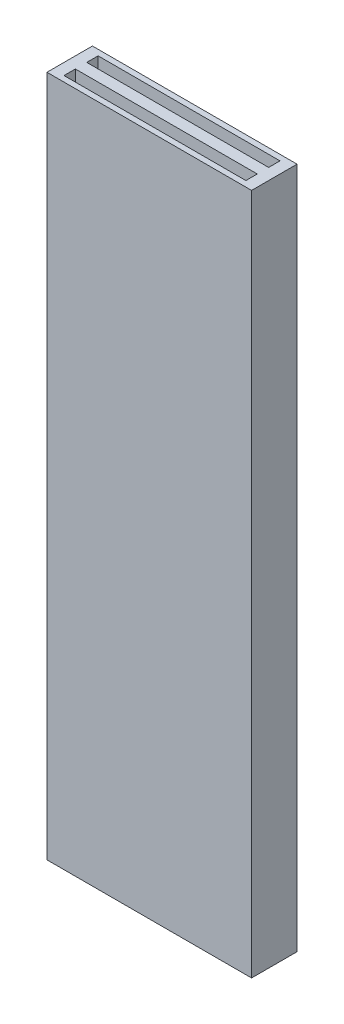
ISO-10303-21;
HEADER;
FILE_DESCRIPTION(('STEP AP214'),'2;1');
FILE_NAME('part.step','',(''),(''),'','','');
FILE_SCHEMA(('AUTOMOTIVE_DESIGN { 1 0 10303 214 1 1 1 1 }'));
ENDSEC;
DATA;
#1=APPLICATION_CONTEXT('core data for automotive mechanical design processes');
#2=APPLICATION_PROTOCOL_DEFINITION('international standard','automotive_design',2000,#1);
#3=PRODUCT_CONTEXT('',#1,'mechanical');
#4=PRODUCT('Part','Part','',(#3));
#5=PRODUCT_RELATED_PRODUCT_CATEGORY('part','',(#4));
#6=PRODUCT_DEFINITION_FORMATION('','',#4);
#7=PRODUCT_DEFINITION_CONTEXT('part definition',#1,'design');
#8=PRODUCT_DEFINITION('design','',#6,#7);
#9=PRODUCT_DEFINITION_SHAPE('','',#8);
#10=(LENGTH_UNIT() NAMED_UNIT(*) SI_UNIT(.MILLI.,.METRE.));
#11=(NAMED_UNIT(*) PLANE_ANGLE_UNIT() SI_UNIT($,.RADIAN.));
#12=(NAMED_UNIT(*) SI_UNIT($,.STERADIAN.) SOLID_ANGLE_UNIT());
#13=UNCERTAINTY_MEASURE_WITH_UNIT(LENGTH_MEASURE(1.E-05),#10,'distance_accuracy_value','');
#14=(GEOMETRIC_REPRESENTATION_CONTEXT(3) GLOBAL_UNCERTAINTY_ASSIGNED_CONTEXT((#13)) GLOBAL_UNIT_ASSIGNED_CONTEXT((#10,
#11,#12)) REPRESENTATION_CONTEXT('',''));
#15=CARTESIAN_POINT('',(0.,0.,0.));
#16=DIRECTION('',(0.,0.,1.));
#17=DIRECTION('',(1.,0.,0.));
#18=AXIS2_PLACEMENT_3D('',#15,#16,#17);
#19=CARTESIAN_POINT('',(0.,15.,0.));
#20=DIRECTION('',(0.,-1.,0.));
#21=DIRECTION('',(0.,0.,-1.));
#22=AXIS2_PLACEMENT_3D('',#19,#20,#21);
#23=PLANE('',#22);
#24=DIRECTION('',(0.,0.,-1.));
#25=VECTOR('',#24,1.);
#26=CARTESIAN_POINT('',(4.5,15.,1.));
#27=LINE('',#26,#25);
#28=CARTESIAN_POINT('',(4.5,15.,1.));
#29=VERTEX_POINT('',#28);
#30=CARTESIAN_POINT('',(4.5,15.,-1.));
#31=VERTEX_POINT('',#30);
#32=EDGE_CURVE('E222',#29,#31,#27,.T.);
#33=ORIENTED_EDGE('',*,*,#32,.T.);
#34=DIRECTION('',(-1.,0.,0.));
#35=VECTOR('',#34,1.);
#36=CARTESIAN_POINT('',(-4.5,15.,-1.));
#37=LINE('',#36,#35);
#38=CARTESIAN_POINT('',(-4.5,15.,-1.));
#39=VERTEX_POINT('',#38);
#40=EDGE_CURVE('E226',#31,#39,#37,.T.);
#41=ORIENTED_EDGE('',*,*,#40,.T.);
#42=DIRECTION('',(0.,0.,1.));
#43=VECTOR('',#42,1.);
#44=CARTESIAN_POINT('',(-4.5,15.,1.));
#45=LINE('',#44,#43);
#46=CARTESIAN_POINT('',(-4.5,15.,1.));
#47=VERTEX_POINT('',#46);
#48=EDGE_CURVE('E230',#39,#47,#45,.T.);
#49=ORIENTED_EDGE('',*,*,#48,.T.);
#50=DIRECTION('',(1.,0.,0.));
#51=VECTOR('',#50,1.);
#52=CARTESIAN_POINT('',(-4.5,15.,1.));
#53=LINE('',#52,#51);
#54=EDGE_CURVE('E233',#47,#29,#53,.T.);
#55=ORIENTED_EDGE('',*,*,#54,.T.);
#56=EDGE_LOOP('',(#33,#41,#49,#55));
#57=FACE_BOUND('',#56,.T.);
#58=DIRECTION('',(1.,0.,0.));
#59=VECTOR('',#58,1.);
#60=CARTESIAN_POINT('',(0.,15.,-0.75));
#61=LINE('',#60,#59);
#62=CARTESIAN_POINT('',(-4.,15.,-0.75));
#63=VERTEX_POINT('',#62);
#64=CARTESIAN_POINT('',(4.,15.,-0.75));
#65=VERTEX_POINT('',#64);
#66=EDGE_CURVE('E195',#63,#65,#61,.T.);
#67=ORIENTED_EDGE('',*,*,#66,.T.);
#68=DIRECTION('',(0.,0.,1.));
#69=VECTOR('',#68,1.);
#70=CARTESIAN_POINT('',(4.,15.,0.));
#71=LINE('',#70,#69);
#72=CARTESIAN_POINT('',(4.,15.,-0.25));
#73=VERTEX_POINT('',#72);
#74=EDGE_CURVE('E217',#65,#73,#71,.T.);
#75=ORIENTED_EDGE('',*,*,#74,.T.);
#76=DIRECTION('',(-1.,0.,0.));
#77=VECTOR('',#76,1.);
#78=CARTESIAN_POINT('',(0.,15.,-0.25));
#79=LINE('',#78,#77);
#80=CARTESIAN_POINT('',(-4.,15.,-0.25));
#81=VERTEX_POINT('',#80);
#82=EDGE_CURVE('E213',#73,#81,#79,.T.);
#83=ORIENTED_EDGE('',*,*,#82,.T.);
#84=DIRECTION('',(0.,0.,-1.));
#85=VECTOR('',#84,1.);
#86=CARTESIAN_POINT('',(-4.,15.,0.));
#87=LINE('',#86,#85);
#88=EDGE_CURVE('E209',#81,#63,#87,.T.);
#89=ORIENTED_EDGE('',*,*,#88,.T.);
#90=EDGE_LOOP('',(#67,#75,#83,#89));
#91=FACE_BOUND('',#90,.T.);
#92=DIRECTION('',(0.,0.,-1.));
#93=VECTOR('',#92,1.);
#94=CARTESIAN_POINT('',(4.,15.,0.));
#95=LINE('',#94,#93);
#96=CARTESIAN_POINT('',(4.,15.,0.75));
#97=VERTEX_POINT('',#96);
#98=CARTESIAN_POINT('',(4.,15.,0.25));
#99=VERTEX_POINT('',#98);
#100=EDGE_CURVE('E140',#97,#99,#95,.T.);
#101=ORIENTED_EDGE('',*,*,#100,.F.);
#102=DIRECTION('',(1.,0.,0.));
#103=VECTOR('',#102,1.);
#104=CARTESIAN_POINT('',(0.,15.,0.75));
#105=LINE('',#104,#103);
#106=CARTESIAN_POINT('',(-4.,15.,0.75));
#107=VERTEX_POINT('',#106);
#108=EDGE_CURVE('E169',#107,#97,#105,.T.);
#109=ORIENTED_EDGE('',*,*,#108,.F.);
#110=DIRECTION('',(0.,0.,1.));
#111=VECTOR('',#110,1.);
#112=CARTESIAN_POINT('',(-4.,15.,0.));
#113=LINE('',#112,#111);
#114=CARTESIAN_POINT('',(-4.,15.,0.25));
#115=VERTEX_POINT('',#114);
#116=EDGE_CURVE('E166',#115,#107,#113,.T.);
#117=ORIENTED_EDGE('',*,*,#116,.F.);
#118=DIRECTION('',(-1.,0.,0.));
#119=VECTOR('',#118,1.);
#120=CARTESIAN_POINT('',(0.,15.,0.25));
#121=LINE('',#120,#119);
#122=EDGE_CURVE('E157',#99,#115,#121,.T.);
#123=ORIENTED_EDGE('',*,*,#122,.F.);
#124=EDGE_LOOP('',(#101,#109,#117,#123));
#125=FACE_BOUND('',#124,.T.);
#126=ADVANCED_FACE('F39',(#57,#91,#125),#23,.F.);
#127=CARTESIAN_POINT('',(0.,-15.,0.));
#128=DIRECTION('',(0.,-1.,0.));
#129=DIRECTION('',(0.,0.,-1.));
#130=AXIS2_PLACEMENT_3D('',#127,#128,#129);
#131=PLANE('',#130);
#132=DIRECTION('',(0.,0.,-1.));
#133=VECTOR('',#132,1.);
#134=CARTESIAN_POINT('',(4.,-15.,-0.25));
#135=LINE('',#134,#133);
#136=CARTESIAN_POINT('',(4.,-15.,-0.25));
#137=VERTEX_POINT('',#136);
#138=CARTESIAN_POINT('',(4.,-15.,-0.75));
#139=VERTEX_POINT('',#138);
#140=EDGE_CURVE('E174',#137,#139,#135,.T.);
#141=ORIENTED_EDGE('',*,*,#140,.T.);
#142=DIRECTION('',(-1.,0.,0.));
#143=VECTOR('',#142,1.);
#144=CARTESIAN_POINT('',(-4.,-15.,-0.75));
#145=LINE('',#144,#143);
#146=CARTESIAN_POINT('',(-4.,-15.,-0.75));
#147=VERTEX_POINT('',#146);
#148=EDGE_CURVE('E178',#139,#147,#145,.T.);
#149=ORIENTED_EDGE('',*,*,#148,.T.);
#150=DIRECTION('',(0.,0.,1.));
#151=VECTOR('',#150,1.);
#152=CARTESIAN_POINT('',(-4.,-15.,-0.25));
#153=LINE('',#152,#151);
#154=CARTESIAN_POINT('',(-4.,-15.,-0.25));
#155=VERTEX_POINT('',#154);
#156=EDGE_CURVE('E182',#147,#155,#153,.T.);
#157=ORIENTED_EDGE('',*,*,#156,.T.);
#158=DIRECTION('',(1.,0.,0.));
#159=VECTOR('',#158,1.);
#160=CARTESIAN_POINT('',(-4.,-15.,-0.25));
#161=LINE('',#160,#159);
#162=EDGE_CURVE('E186',#155,#137,#161,.T.);
#163=ORIENTED_EDGE('',*,*,#162,.T.);
#164=EDGE_LOOP('',(#141,#149,#157,#163));
#165=FACE_BOUND('',#164,.T.);
#166=DIRECTION('',(0.,0.,-1.));
#167=VECTOR('',#166,1.);
#168=CARTESIAN_POINT('',(4.5,-15.,1.));
#169=LINE('',#168,#167);
#170=CARTESIAN_POINT('',(4.5,-15.,1.));
#171=VERTEX_POINT('',#170);
#172=CARTESIAN_POINT('',(4.5,-15.,-1.));
#173=VERTEX_POINT('',#172);
#174=EDGE_CURVE('E221',#171,#173,#169,.T.);
#175=ORIENTED_EDGE('',*,*,#174,.F.);
#176=DIRECTION('',(1.,0.,0.));
#177=VECTOR('',#176,1.);
#178=CARTESIAN_POINT('',(-4.5,-15.,1.));
#179=LINE('',#178,#177);
#180=CARTESIAN_POINT('',(-4.5,-15.,1.));
#181=VERTEX_POINT('',#180);
#182=EDGE_CURVE('E227',#181,#171,#179,.T.);
#183=ORIENTED_EDGE('',*,*,#182,.F.);
#184=DIRECTION('',(0.,0.,1.));
#185=VECTOR('',#184,1.);
#186=CARTESIAN_POINT('',(-4.5,-15.,1.));
#187=LINE('',#186,#185);
#188=CARTESIAN_POINT('',(-4.5,-15.,-1.));
#189=VERTEX_POINT('',#188);
#190=EDGE_CURVE('E243',#189,#181,#187,.T.);
#191=ORIENTED_EDGE('',*,*,#190,.F.);
#192=DIRECTION('',(-1.,0.,0.));
#193=VECTOR('',#192,1.);
#194=CARTESIAN_POINT('',(-4.5,-15.,-1.));
#195=LINE('',#194,#193);
#196=EDGE_CURVE('E240',#173,#189,#195,.T.);
#197=ORIENTED_EDGE('',*,*,#196,.F.);
#198=EDGE_LOOP('',(#175,#183,#191,#197));
#199=FACE_BOUND('',#198,.T.);
#200=DIRECTION('',(-1.,0.,0.));
#201=VECTOR('',#200,1.);
#202=CARTESIAN_POINT('',(-4.,-15.,0.75));
#203=LINE('',#202,#201);
#204=CARTESIAN_POINT('',(4.,-15.,0.75));
#205=VERTEX_POINT('',#204);
#206=CARTESIAN_POINT('',(-4.,-15.,0.75));
#207=VERTEX_POINT('',#206);
#208=EDGE_CURVE('E143',#205,#207,#203,.T.);
#209=ORIENTED_EDGE('',*,*,#208,.F.);
#210=DIRECTION('',(0.,0.,1.));
#211=VECTOR('',#210,1.);
#212=CARTESIAN_POINT('',(4.,-15.,0.25));
#213=LINE('',#212,#211);
#214=CARTESIAN_POINT('',(4.,-15.,0.25));
#215=VERTEX_POINT('',#214);
#216=EDGE_CURVE('E133',#215,#205,#213,.T.);
#217=ORIENTED_EDGE('',*,*,#216,.F.);
#218=DIRECTION('',(1.,0.,0.));
#219=VECTOR('',#218,1.);
#220=CARTESIAN_POINT('',(-4.,-15.,0.25));
#221=LINE('',#220,#219);
#222=CARTESIAN_POINT('',(-4.,-15.,0.25));
#223=VERTEX_POINT('',#222);
#224=EDGE_CURVE('E126',#223,#215,#221,.T.);
#225=ORIENTED_EDGE('',*,*,#224,.F.);
#226=DIRECTION('',(0.,0.,-1.));
#227=VECTOR('',#226,1.);
#228=CARTESIAN_POINT('',(-4.,-15.,0.25));
#229=LINE('',#228,#227);
#230=EDGE_CURVE('E132',#207,#223,#229,.T.);
#231=ORIENTED_EDGE('',*,*,#230,.F.);
#232=EDGE_LOOP('',(#209,#217,#225,#231));
#233=FACE_BOUND('',#232,.T.);
#234=ADVANCED_FACE('F146',(#165,#199,#233),#131,.T.);
#235=CARTESIAN_POINT('',(4.5,15.,1.));
#236=DIRECTION('',(-1.,0.,0.));
#237=DIRECTION('',(0.,0.,1.));
#238=AXIS2_PLACEMENT_3D('',#235,#236,#237);
#239=PLANE('',#238);
#240=ORIENTED_EDGE('',*,*,#174,.T.);
#241=DIRECTION('',(0.,-1.,0.));
#242=VECTOR('',#241,1.);
#243=CARTESIAN_POINT('',(4.5,15.,-1.));
#244=LINE('',#243,#242);
#245=EDGE_CURVE('E11',#31,#173,#244,.T.);
#246=ORIENTED_EDGE('',*,*,#245,.F.);
#247=ORIENTED_EDGE('',*,*,#32,.F.);
#248=DIRECTION('',(0.,-1.,0.));
#249=VECTOR('',#248,1.);
#250=CARTESIAN_POINT('',(4.5,15.,1.));
#251=LINE('',#250,#249);
#252=EDGE_CURVE('E236',#29,#171,#251,.T.);
#253=ORIENTED_EDGE('',*,*,#252,.T.);
#254=EDGE_LOOP('',(#240,#246,#247,#253));
#255=FACE_BOUND('',#254,.T.);
#256=ADVANCED_FACE('F41',(#255),#239,.F.);
#257=CARTESIAN_POINT('',(-4.5,15.,-1.));
#258=DIRECTION('',(0.,0.,1.));
#259=DIRECTION('',(1.,0.,0.));
#260=AXIS2_PLACEMENT_3D('',#257,#258,#259);
#261=PLANE('',#260);
#262=ORIENTED_EDGE('',*,*,#196,.T.);
#263=DIRECTION('',(0.,-1.,0.));
#264=VECTOR('',#263,1.);
#265=CARTESIAN_POINT('',(-4.5,15.,-1.));
#266=LINE('',#265,#264);
#267=EDGE_CURVE('E48',#39,#189,#266,.T.);
#268=ORIENTED_EDGE('',*,*,#267,.F.);
#269=ORIENTED_EDGE('',*,*,#40,.F.);
#270=ORIENTED_EDGE('',*,*,#245,.T.);
#271=EDGE_LOOP('',(#262,#268,#269,#270));
#272=FACE_BOUND('',#271,.T.);
#273=ADVANCED_FACE('F275',(#272),#261,.F.);
#274=CARTESIAN_POINT('',(-4.5,15.,1.));
#275=DIRECTION('',(1.,0.,0.));
#276=DIRECTION('',(0.,0.,-1.));
#277=AXIS2_PLACEMENT_3D('',#274,#275,#276);
#278=PLANE('',#277);
#279=ORIENTED_EDGE('',*,*,#190,.T.);
#280=DIRECTION('',(0.,-1.,0.));
#281=VECTOR('',#280,1.);
#282=CARTESIAN_POINT('',(-4.5,15.,1.));
#283=LINE('',#282,#281);
#284=EDGE_CURVE('E251',#47,#181,#283,.T.);
#285=ORIENTED_EDGE('',*,*,#284,.F.);
#286=ORIENTED_EDGE('',*,*,#48,.F.);
#287=ORIENTED_EDGE('',*,*,#267,.T.);
#288=EDGE_LOOP('',(#279,#285,#286,#287));
#289=FACE_BOUND('',#288,.T.);
#290=ADVANCED_FACE('F260',(#289),#278,.F.);
#291=CARTESIAN_POINT('',(-4.5,15.,1.));
#292=DIRECTION('',(0.,0.,-1.));
#293=DIRECTION('',(-1.,0.,0.));
#294=AXIS2_PLACEMENT_3D('',#291,#292,#293);
#295=PLANE('',#294);
#296=ORIENTED_EDGE('',*,*,#182,.T.);
#297=ORIENTED_EDGE('',*,*,#252,.F.);
#298=ORIENTED_EDGE('',*,*,#54,.F.);
#299=ORIENTED_EDGE('',*,*,#284,.T.);
#300=EDGE_LOOP('',(#296,#297,#298,#299));
#301=FACE_BOUND('',#300,.T.);
#302=ADVANCED_FACE('F268',(#301),#295,.F.);
#303=CARTESIAN_POINT('',(4.,-15.,-0.25));
#304=DIRECTION('',(1.,0.,0.));
#305=DIRECTION('',(0.,0.,-1.));
#306=AXIS2_PLACEMENT_3D('',#303,#304,#305);
#307=PLANE('',#306);
#308=DIRECTION('',(0.,1.,0.));
#309=VECTOR('',#308,1.);
#310=CARTESIAN_POINT('',(4.,-15.,-0.75));
#311=LINE('',#310,#309);
#312=EDGE_CURVE('E190',#139,#65,#311,.T.);
#313=ORIENTED_EDGE('',*,*,#312,.F.);
#314=ORIENTED_EDGE('',*,*,#140,.F.);
#315=DIRECTION('',(0.,1.,0.));
#316=VECTOR('',#315,1.);
#317=CARTESIAN_POINT('',(4.,-15.,-0.25));
#318=LINE('',#317,#316);
#319=EDGE_CURVE('E191',#137,#73,#318,.T.);
#320=ORIENTED_EDGE('',*,*,#319,.T.);
#321=ORIENTED_EDGE('',*,*,#74,.F.);
#322=EDGE_LOOP('',(#313,#314,#320,#321));
#323=FACE_BOUND('',#322,.T.);
#324=ADVANCED_FACE('F290',(#323),#307,.F.);
#325=CARTESIAN_POINT('',(-4.,-15.,-0.25));
#326=DIRECTION('',(0.,0.,1.));
#327=DIRECTION('',(1.,0.,0.));
#328=AXIS2_PLACEMENT_3D('',#325,#326,#327);
#329=PLANE('',#328);
#330=ORIENTED_EDGE('',*,*,#319,.F.);
#331=ORIENTED_EDGE('',*,*,#162,.F.);
#332=DIRECTION('',(0.,1.,0.));
#333=VECTOR('',#332,1.);
#334=CARTESIAN_POINT('',(-4.,-15.,-0.25));
#335=LINE('',#334,#333);
#336=EDGE_CURVE('E196',#155,#81,#335,.T.);
#337=ORIENTED_EDGE('',*,*,#336,.T.);
#338=ORIENTED_EDGE('',*,*,#82,.F.);
#339=EDGE_LOOP('',(#330,#331,#337,#338));
#340=FACE_BOUND('',#339,.T.);
#341=ADVANCED_FACE('F297',(#340),#329,.F.);
#342=CARTESIAN_POINT('',(-4.,-15.,-0.25));
#343=DIRECTION('',(-1.,0.,0.));
#344=DIRECTION('',(0.,0.,1.));
#345=AXIS2_PLACEMENT_3D('',#342,#343,#344);
#346=PLANE('',#345);
#347=ORIENTED_EDGE('',*,*,#336,.F.);
#348=ORIENTED_EDGE('',*,*,#156,.F.);
#349=DIRECTION('',(0.,1.,0.));
#350=VECTOR('',#349,1.);
#351=CARTESIAN_POINT('',(-4.,-15.,-0.75));
#352=LINE('',#351,#350);
#353=EDGE_CURVE('E200',#147,#63,#352,.T.);
#354=ORIENTED_EDGE('',*,*,#353,.T.);
#355=ORIENTED_EDGE('',*,*,#88,.F.);
#356=EDGE_LOOP('',(#347,#348,#354,#355));
#357=FACE_BOUND('',#356,.T.);
#358=ADVANCED_FACE('F302',(#357),#346,.F.);
#359=CARTESIAN_POINT('',(-4.,-15.,-0.75));
#360=DIRECTION('',(0.,0.,-1.));
#361=DIRECTION('',(-1.,0.,0.));
#362=AXIS2_PLACEMENT_3D('',#359,#360,#361);
#363=PLANE('',#362);
#364=ORIENTED_EDGE('',*,*,#353,.F.);
#365=ORIENTED_EDGE('',*,*,#148,.F.);
#366=ORIENTED_EDGE('',*,*,#312,.T.);
#367=ORIENTED_EDGE('',*,*,#66,.F.);
#368=EDGE_LOOP('',(#364,#365,#366,#367));
#369=FACE_BOUND('',#368,.T.);
#370=ADVANCED_FACE('F310',(#369),#363,.F.);
#371=CARTESIAN_POINT('',(4.,-15.,0.25));
#372=DIRECTION('',(-1.,0.,0.));
#373=DIRECTION('',(0.,0.,1.));
#374=AXIS2_PLACEMENT_3D('',#371,#372,#373);
#375=PLANE('',#374);
#376=ORIENTED_EDGE('',*,*,#100,.T.);
#377=DIRECTION('',(0.,1.,0.));
#378=VECTOR('',#377,1.);
#379=CARTESIAN_POINT('',(4.,-15.,0.25));
#380=LINE('',#379,#378);
#381=EDGE_CURVE('E55',#215,#99,#380,.T.);
#382=ORIENTED_EDGE('',*,*,#381,.F.);
#383=ORIENTED_EDGE('',*,*,#216,.T.);
#384=DIRECTION('',(0.,1.,0.));
#385=VECTOR('',#384,1.);
#386=CARTESIAN_POINT('',(4.,-15.,0.75));
#387=LINE('',#386,#385);
#388=EDGE_CURVE('E154',#205,#97,#387,.T.);
#389=ORIENTED_EDGE('',*,*,#388,.T.);
#390=EDGE_LOOP('',(#376,#382,#383,#389));
#391=FACE_BOUND('',#390,.T.);
#392=ADVANCED_FACE('F136',(#391),#375,.T.);
#393=CARTESIAN_POINT('',(-4.,-15.,0.75));
#394=DIRECTION('',(0.,0.,-1.));
#395=DIRECTION('',(-1.,0.,0.));
#396=AXIS2_PLACEMENT_3D('',#393,#394,#395);
#397=PLANE('',#396);
#398=ORIENTED_EDGE('',*,*,#108,.T.);
#399=ORIENTED_EDGE('',*,*,#388,.F.);
#400=ORIENTED_EDGE('',*,*,#208,.T.);
#401=DIRECTION('',(0.,1.,0.));
#402=VECTOR('',#401,1.);
#403=CARTESIAN_POINT('',(-4.,-15.,0.75));
#404=LINE('',#403,#402);
#405=EDGE_CURVE('E158',#207,#107,#404,.T.);
#406=ORIENTED_EDGE('',*,*,#405,.T.);
#407=EDGE_LOOP('',(#398,#399,#400,#406));
#408=FACE_BOUND('',#407,.T.);
#409=ADVANCED_FACE('F322',(#408),#397,.T.);
#410=CARTESIAN_POINT('',(-4.,-15.,0.25));
#411=DIRECTION('',(1.,0.,0.));
#412=DIRECTION('',(0.,0.,-1.));
#413=AXIS2_PLACEMENT_3D('',#410,#411,#412);
#414=PLANE('',#413);
#415=ORIENTED_EDGE('',*,*,#116,.T.);
#416=ORIENTED_EDGE('',*,*,#405,.F.);
#417=ORIENTED_EDGE('',*,*,#230,.T.);
#418=DIRECTION('',(0.,1.,0.));
#419=VECTOR('',#418,1.);
#420=CARTESIAN_POINT('',(-4.,-15.,0.25));
#421=LINE('',#420,#419);
#422=EDGE_CURVE('E60',#223,#115,#421,.T.);
#423=ORIENTED_EDGE('',*,*,#422,.T.);
#424=EDGE_LOOP('',(#415,#416,#417,#423));
#425=FACE_BOUND('',#424,.T.);
#426=ADVANCED_FACE('F325',(#425),#414,.T.);
#427=CARTESIAN_POINT('',(-4.,-15.,0.25));
#428=DIRECTION('',(0.,0.,1.));
#429=DIRECTION('',(1.,0.,0.));
#430=AXIS2_PLACEMENT_3D('',#427,#428,#429);
#431=PLANE('',#430);
#432=ORIENTED_EDGE('',*,*,#122,.T.);
#433=ORIENTED_EDGE('',*,*,#422,.F.);
#434=ORIENTED_EDGE('',*,*,#224,.T.);
#435=ORIENTED_EDGE('',*,*,#381,.T.);
#436=EDGE_LOOP('',(#432,#433,#434,#435));
#437=FACE_BOUND('',#436,.T.);
#438=ADVANCED_FACE('F127',(#437),#431,.T.);
#439=CLOSED_SHELL('',(#126,#234,#256,#273,#290,#302,#324,#341,#358,#370,#392,#409,#426,#438));
#440=MANIFOLD_SOLID_BREP('B2',#439);
#441=ADVANCED_BREP_SHAPE_REPRESENTATION('',(#18,#440),#14);
#442=SHAPE_DEFINITION_REPRESENTATION(#9,#441);
ENDSEC;
END-ISO-10303-21;
